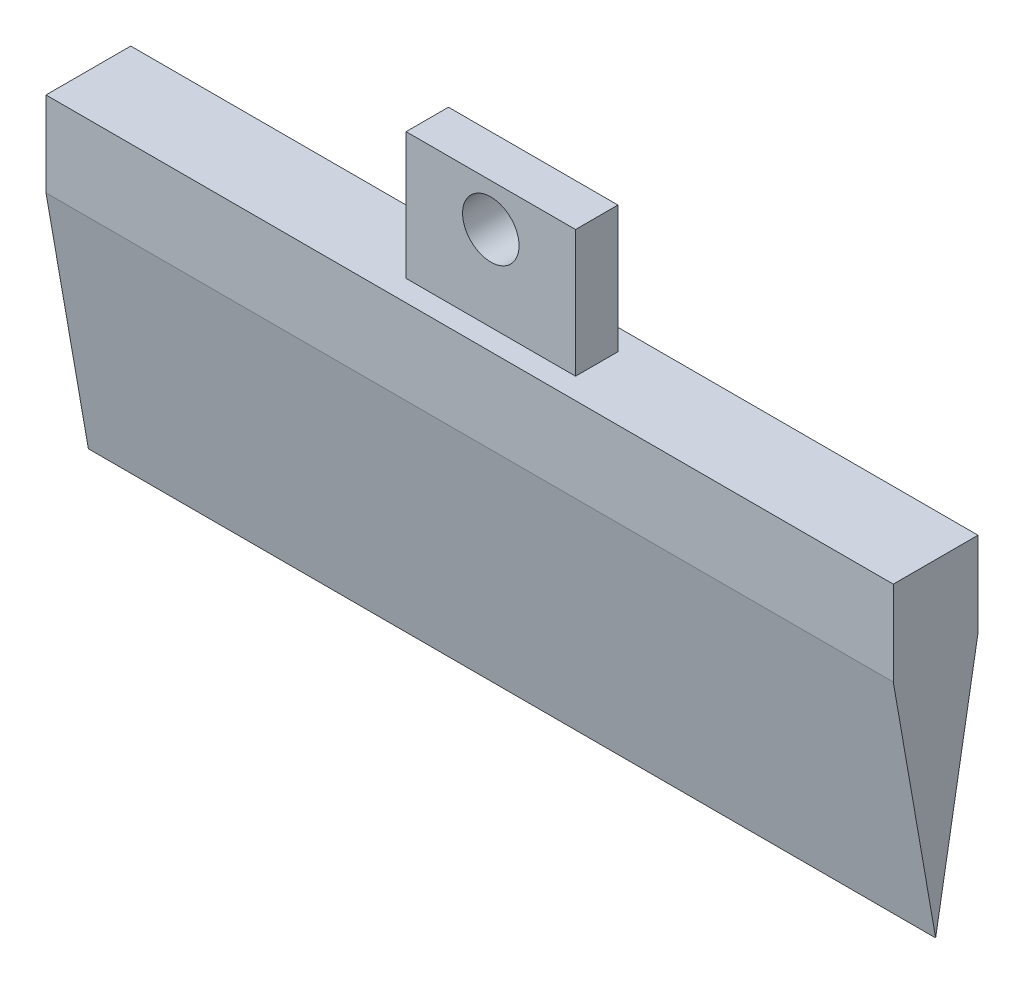
ISO-10303-21;
HEADER;
FILE_DESCRIPTION(('STEP AP214'),'2;1');
FILE_NAME('part.step','',(''),(''),'','','');
FILE_SCHEMA(('AUTOMOTIVE_DESIGN { 1 0 10303 214 1 1 1 1 }'));
ENDSEC;
DATA;
#1=APPLICATION_CONTEXT('core data for automotive mechanical design processes');
#2=APPLICATION_PROTOCOL_DEFINITION('international standard','automotive_design',2000,#1);
#3=PRODUCT_CONTEXT('',#1,'mechanical');
#4=PRODUCT('Part','Part','',(#3));
#5=PRODUCT_RELATED_PRODUCT_CATEGORY('part','',(#4));
#6=PRODUCT_DEFINITION_FORMATION('','',#4);
#7=PRODUCT_DEFINITION_CONTEXT('part definition',#1,'design');
#8=PRODUCT_DEFINITION('design','',#6,#7);
#9=PRODUCT_DEFINITION_SHAPE('','',#8);
#10=(LENGTH_UNIT() NAMED_UNIT(*) SI_UNIT(.MILLI.,.METRE.));
#11=(NAMED_UNIT(*) PLANE_ANGLE_UNIT() SI_UNIT($,.RADIAN.));
#12=(NAMED_UNIT(*) SI_UNIT($,.STERADIAN.) SOLID_ANGLE_UNIT());
#13=UNCERTAINTY_MEASURE_WITH_UNIT(LENGTH_MEASURE(1.E-05),#10,'distance_accuracy_value','');
#14=(GEOMETRIC_REPRESENTATION_CONTEXT(3) GLOBAL_UNCERTAINTY_ASSIGNED_CONTEXT((#13)) GLOBAL_UNIT_ASSIGNED_CONTEXT((#10,
#11,#12)) REPRESENTATION_CONTEXT('',''));
#15=CARTESIAN_POINT('',(0.,0.,0.));
#16=DIRECTION('',(0.,0.,1.));
#17=DIRECTION('',(1.,0.,0.));
#18=AXIS2_PLACEMENT_3D('',#15,#16,#17);
#19=CARTESIAN_POINT('',(-300.,0.,15.));
#20=DIRECTION('',(0.,1.,0.));
#21=DIRECTION('',(0.,0.,1.));
#22=AXIS2_PLACEMENT_3D('',#19,#20,#21);
#23=PLANE('',#22);
#24=DIRECTION('',(0.,0.,1.));
#25=VECTOR('',#24,1.);
#26=CARTESIAN_POINT('',(0.,0.,15.));
#27=LINE('',#26,#25);
#28=CARTESIAN_POINT('',(0.,0.,-15.));
#29=VERTEX_POINT('',#28);
#30=CARTESIAN_POINT('',(0.,0.,15.));
#31=VERTEX_POINT('',#30);
#32=EDGE_CURVE('E137',#29,#31,#27,.T.);
#33=ORIENTED_EDGE('',*,*,#32,.F.);
#34=DIRECTION('',(1.,0.,0.));
#35=VECTOR('',#34,1.);
#36=CARTESIAN_POINT('',(-300.,0.,-15.));
#37=LINE('',#36,#35);
#38=CARTESIAN_POINT('',(-300.,0.,-15.));
#39=VERTEX_POINT('',#38);
#40=EDGE_CURVE('E45',#39,#29,#37,.T.);
#41=ORIENTED_EDGE('',*,*,#40,.F.);
#42=DIRECTION('',(0.,0.,1.));
#43=VECTOR('',#42,1.);
#44=CARTESIAN_POINT('',(-300.,0.,15.));
#45=LINE('',#44,#43);
#46=CARTESIAN_POINT('',(-300.,0.,15.));
#47=VERTEX_POINT('',#46);
#48=EDGE_CURVE('E117',#39,#47,#45,.T.);
#49=ORIENTED_EDGE('',*,*,#48,.T.);
#50=DIRECTION('',(1.,0.,0.));
#51=VECTOR('',#50,1.);
#52=CARTESIAN_POINT('',(-300.,0.,15.));
#53=LINE('',#52,#51);
#54=EDGE_CURVE('E11',#47,#31,#53,.T.);
#55=ORIENTED_EDGE('',*,*,#54,.T.);
#56=EDGE_LOOP('',(#33,#41,#49,#55));
#57=FACE_BOUND('',#56,.T.);
#58=DIRECTION('',(0.,0.,-1.));
#59=VECTOR('',#58,1.);
#60=CARTESIAN_POINT('',(-180.,0.,7.5));
#61=LINE('',#60,#59);
#62=CARTESIAN_POINT('',(-180.,0.,7.5));
#63=VERTEX_POINT('',#62);
#64=CARTESIAN_POINT('',(-180.,0.,-7.5));
#65=VERTEX_POINT('',#64);
#66=EDGE_CURVE('E149',#63,#65,#61,.T.);
#67=ORIENTED_EDGE('',*,*,#66,.T.);
#68=DIRECTION('',(1.,0.,0.));
#69=VECTOR('',#68,1.);
#70=CARTESIAN_POINT('',(-120.,0.,-7.5));
#71=LINE('',#70,#69);
#72=CARTESIAN_POINT('',(-120.,0.,-7.5));
#73=VERTEX_POINT('',#72);
#74=EDGE_CURVE('E53',#65,#73,#71,.T.);
#75=ORIENTED_EDGE('',*,*,#74,.T.);
#76=DIRECTION('',(0.,0.,-1.));
#77=VECTOR('',#76,1.);
#78=CARTESIAN_POINT('',(-120.,0.,7.5));
#79=LINE('',#78,#77);
#80=CARTESIAN_POINT('',(-120.,0.,7.5));
#81=VERTEX_POINT('',#80);
#82=EDGE_CURVE('E157',#81,#73,#79,.T.);
#83=ORIENTED_EDGE('',*,*,#82,.F.);
#84=DIRECTION('',(1.,0.,0.));
#85=VECTOR('',#84,1.);
#86=CARTESIAN_POINT('',(-120.,0.,7.5));
#87=LINE('',#86,#85);
#88=EDGE_CURVE('E153',#63,#81,#87,.T.);
#89=ORIENTED_EDGE('',*,*,#88,.F.);
#90=EDGE_LOOP('',(#67,#75,#83,#89));
#91=FACE_BOUND('',#90,.T.);
#92=ADVANCED_FACE('F36',(#57,#91),#23,.T.);
#93=CARTESIAN_POINT('',(-300.,-30.,15.));
#94=DIRECTION('',(0.,0.,1.));
#95=DIRECTION('',(1.,0.,0.));
#96=AXIS2_PLACEMENT_3D('',#93,#94,#95);
#97=PLANE('',#96);
#98=DIRECTION('',(0.,-1.,0.));
#99=VECTOR('',#98,1.);
#100=CARTESIAN_POINT('',(0.,-30.,15.));
#101=LINE('',#100,#99);
#102=CARTESIAN_POINT('',(0.,-30.,15.));
#103=VERTEX_POINT('',#102);
#104=EDGE_CURVE('E127',#31,#103,#101,.T.);
#105=ORIENTED_EDGE('',*,*,#104,.F.);
#106=ORIENTED_EDGE('',*,*,#54,.F.);
#107=DIRECTION('',(0.,-1.,0.));
#108=VECTOR('',#107,1.);
#109=CARTESIAN_POINT('',(-300.,-30.,15.));
#110=LINE('',#109,#108);
#111=CARTESIAN_POINT('',(-300.,-30.,15.));
#112=VERTEX_POINT('',#111);
#113=EDGE_CURVE('E122',#47,#112,#110,.T.);
#114=ORIENTED_EDGE('',*,*,#113,.T.);
#115=DIRECTION('',(1.,0.,0.));
#116=VECTOR('',#115,1.);
#117=CARTESIAN_POINT('',(-300.,-30.,15.));
#118=LINE('',#117,#116);
#119=EDGE_CURVE('E40',#112,#103,#118,.T.);
#120=ORIENTED_EDGE('',*,*,#119,.T.);
#121=EDGE_LOOP('',(#105,#106,#114,#120));
#122=FACE_BOUND('',#121,.T.);
#123=ADVANCED_FACE('F38',(#122),#97,.T.);
#124=CARTESIAN_POINT('',(-300.,0.,-15.));
#125=DIRECTION('',(0.,0.,-1.));
#126=DIRECTION('',(-1.,0.,0.));
#127=AXIS2_PLACEMENT_3D('',#124,#125,#126);
#128=PLANE('',#127);
#129=DIRECTION('',(0.,1.,0.));
#130=VECTOR('',#129,1.);
#131=CARTESIAN_POINT('',(0.,0.,-15.));
#132=LINE('',#131,#130);
#133=CARTESIAN_POINT('',(0.,-30.,-15.));
#134=VERTEX_POINT('',#133);
#135=EDGE_CURVE('E106',#134,#29,#132,.T.);
#136=ORIENTED_EDGE('',*,*,#135,.F.);
#137=DIRECTION('',(1.,0.,0.));
#138=VECTOR('',#137,1.);
#139=CARTESIAN_POINT('',(-300.,-30.,-15.));
#140=LINE('',#139,#138);
#141=CARTESIAN_POINT('',(-300.,-30.,-15.));
#142=VERTEX_POINT('',#141);
#143=EDGE_CURVE('E100',#142,#134,#140,.T.);
#144=ORIENTED_EDGE('',*,*,#143,.F.);
#145=DIRECTION('',(0.,1.,0.));
#146=VECTOR('',#145,1.);
#147=CARTESIAN_POINT('',(-300.,0.,-15.));
#148=LINE('',#147,#146);
#149=EDGE_CURVE('E103',#142,#39,#148,.T.);
#150=ORIENTED_EDGE('',*,*,#149,.T.);
#151=ORIENTED_EDGE('',*,*,#40,.T.);
#152=EDGE_LOOP('',(#136,#144,#150,#151));
#153=FACE_BOUND('',#152,.T.);
#154=ADVANCED_FACE('F102',(#153),#128,.T.);
#155=CARTESIAN_POINT('',(-300.,-30.,-15.));
#156=DIRECTION('',(0.,-0.171824574947336,-0.985127563031391));
#157=DIRECTION('',(0.,0.985127563031391,-0.171824574947336));
#158=AXIS2_PLACEMENT_3D('',#155,#156,#157);
#159=PLANE('',#158);
#160=DIRECTION('',(0.,0.985127563031391,-0.171824574947336));
#161=VECTOR('',#160,1.);
#162=CARTESIAN_POINT('',(0.,-30.,-15.));
#163=LINE('',#162,#161);
#164=CARTESIAN_POINT('',(0.,-116.,0.));
#165=VERTEX_POINT('',#164);
#166=EDGE_CURVE('E134',#165,#134,#163,.T.);
#167=ORIENTED_EDGE('',*,*,#166,.F.);
#168=DIRECTION('',(1.,0.,0.));
#169=VECTOR('',#168,1.);
#170=CARTESIAN_POINT('',(-300.,-116.,0.));
#171=LINE('',#170,#169);
#172=CARTESIAN_POINT('',(-300.,-116.,0.));
#173=VERTEX_POINT('',#172);
#174=EDGE_CURVE('E111',#173,#165,#171,.T.);
#175=ORIENTED_EDGE('',*,*,#174,.F.);
#176=DIRECTION('',(0.,0.985127563031391,-0.171824574947336));
#177=VECTOR('',#176,1.);
#178=CARTESIAN_POINT('',(-300.,-30.,-15.));
#179=LINE('',#178,#177);
#180=EDGE_CURVE('E116',#173,#142,#179,.T.);
#181=ORIENTED_EDGE('',*,*,#180,.T.);
#182=ORIENTED_EDGE('',*,*,#143,.T.);
#183=EDGE_LOOP('',(#167,#175,#181,#182));
#184=FACE_BOUND('',#183,.T.);
#185=ADVANCED_FACE('F119',(#184),#159,.T.);
#186=CARTESIAN_POINT('',(-300.,-116.,0.));
#187=DIRECTION('',(0.,-0.171824574947336,0.985127563031391));
#188=DIRECTION('',(0.,-0.985127563031391,-0.171824574947336));
#189=AXIS2_PLACEMENT_3D('',#186,#187,#188);
#190=PLANE('',#189);
#191=DIRECTION('',(0.,-0.985127563031391,-0.171824574947336));
#192=VECTOR('',#191,1.);
#193=CARTESIAN_POINT('',(0.,-116.,0.));
#194=LINE('',#193,#192);
#195=EDGE_CURVE('E130',#103,#165,#194,.T.);
#196=ORIENTED_EDGE('',*,*,#195,.F.);
#197=ORIENTED_EDGE('',*,*,#119,.F.);
#198=DIRECTION('',(0.,-0.985127563031391,-0.171824574947336));
#199=VECTOR('',#198,1.);
#200=CARTESIAN_POINT('',(-300.,-116.,0.));
#201=LINE('',#200,#199);
#202=EDGE_CURVE('E120',#112,#173,#201,.T.);
#203=ORIENTED_EDGE('',*,*,#202,.T.);
#204=ORIENTED_EDGE('',*,*,#174,.T.);
#205=EDGE_LOOP('',(#196,#197,#203,#204));
#206=FACE_BOUND('',#205,.T.);
#207=ADVANCED_FACE('F140',(#206),#190,.T.);
#208=CARTESIAN_POINT('',(-300.,0.,0.));
#209=DIRECTION('',(-1.,0.,0.));
#210=DIRECTION('',(0.,0.,1.));
#211=AXIS2_PLACEMENT_3D('',#208,#209,#210);
#212=PLANE('',#211);
#213=ORIENTED_EDGE('',*,*,#113,.F.);
#214=ORIENTED_EDGE('',*,*,#48,.F.);
#215=ORIENTED_EDGE('',*,*,#149,.F.);
#216=ORIENTED_EDGE('',*,*,#180,.F.);
#217=ORIENTED_EDGE('',*,*,#202,.F.);
#218=EDGE_LOOP('',(#213,#214,#215,#216,#217));
#219=FACE_BOUND('',#218,.T.);
#220=ADVANCED_FACE('F115',(#219),#212,.T.);
#221=CARTESIAN_POINT('',(0.,0.,0.));
#222=DIRECTION('',(-1.,0.,0.));
#223=DIRECTION('',(0.,0.,1.));
#224=AXIS2_PLACEMENT_3D('',#221,#222,#223);
#225=PLANE('',#224);
#226=ORIENTED_EDGE('',*,*,#104,.T.);
#227=ORIENTED_EDGE('',*,*,#195,.T.);
#228=ORIENTED_EDGE('',*,*,#166,.T.);
#229=ORIENTED_EDGE('',*,*,#135,.T.);
#230=ORIENTED_EDGE('',*,*,#32,.T.);
#231=EDGE_LOOP('',(#226,#227,#228,#229,#230));
#232=FACE_BOUND('',#231,.T.);
#233=ADVANCED_FACE('F142',(#232),#225,.F.);
#234=CARTESIAN_POINT('',(0.,0.,7.5));
#235=DIRECTION('',(0.,0.,-1.));
#236=DIRECTION('',(-1.,0.,0.));
#237=AXIS2_PLACEMENT_3D('',#234,#235,#236);
#238=PLANE('',#237);
#239=DIRECTION('',(0.,1.,0.));
#240=VECTOR('',#239,1.);
#241=CARTESIAN_POINT('',(-120.,45.,7.5));
#242=LINE('',#241,#240);
#243=CARTESIAN_POINT('',(-120.,45.,7.5));
#244=VERTEX_POINT('',#243);
#245=EDGE_CURVE('E196',#81,#244,#242,.T.);
#246=ORIENTED_EDGE('',*,*,#245,.T.);
#247=DIRECTION('',(-1.,0.,0.));
#248=VECTOR('',#247,1.);
#249=CARTESIAN_POINT('',(-120.,45.,7.5));
#250=LINE('',#249,#248);
#251=CARTESIAN_POINT('',(-180.,45.,7.5));
#252=VERTEX_POINT('',#251);
#253=EDGE_CURVE('E179',#244,#252,#250,.T.);
#254=ORIENTED_EDGE('',*,*,#253,.T.);
#255=DIRECTION('',(0.,-1.,0.));
#256=VECTOR('',#255,1.);
#257=CARTESIAN_POINT('',(-180.,45.,7.5));
#258=LINE('',#257,#256);
#259=EDGE_CURVE('E199',#252,#63,#258,.T.);
#260=ORIENTED_EDGE('',*,*,#259,.T.);
#261=ORIENTED_EDGE('',*,*,#88,.T.);
#262=EDGE_LOOP('',(#246,#254,#260,#261));
#263=FACE_BOUND('',#262,.T.);
#264=CARTESIAN_POINT('',(-150.,30.,7.5));
#265=DIRECTION('',(0.,0.,1.));
#266=DIRECTION('',(1.,0.,0.));
#267=AXIS2_PLACEMENT_3D('',#264,#265,#266);
#268=CIRCLE('',#267,10.);
#269=CARTESIAN_POINT('',(-140.,30.,7.5));
#270=VERTEX_POINT('',#269);
#271=EDGE_CURVE('E186',#270,#270,#268,.T.);
#272=ORIENTED_EDGE('',*,*,#271,.F.);
#273=EDGE_LOOP('',(#272));
#274=FACE_BOUND('',#273,.T.);
#275=ADVANCED_FACE('F203',(#263,#274),#238,.F.);
#276=CARTESIAN_POINT('',(0.,0.,-7.5));
#277=DIRECTION('',(0.,0.,-1.));
#278=DIRECTION('',(-1.,0.,0.));
#279=AXIS2_PLACEMENT_3D('',#276,#277,#278);
#280=PLANE('',#279);
#281=DIRECTION('',(0.,1.,0.));
#282=VECTOR('',#281,1.);
#283=CARTESIAN_POINT('',(-120.,45.,-7.5));
#284=LINE('',#283,#282);
#285=CARTESIAN_POINT('',(-120.,45.,-7.5));
#286=VERTEX_POINT('',#285);
#287=EDGE_CURVE('E184',#73,#286,#284,.T.);
#288=ORIENTED_EDGE('',*,*,#287,.F.);
#289=ORIENTED_EDGE('',*,*,#74,.F.);
#290=DIRECTION('',(0.,-1.,0.));
#291=VECTOR('',#290,1.);
#292=CARTESIAN_POINT('',(-180.,45.,-7.5));
#293=LINE('',#292,#291);
#294=CARTESIAN_POINT('',(-180.,45.,-7.5));
#295=VERTEX_POINT('',#294);
#296=EDGE_CURVE('E188',#295,#65,#293,.T.);
#297=ORIENTED_EDGE('',*,*,#296,.F.);
#298=DIRECTION('',(-1.,0.,0.));
#299=VECTOR('',#298,1.);
#300=CARTESIAN_POINT('',(-120.,45.,-7.5));
#301=LINE('',#300,#299);
#302=EDGE_CURVE('E176',#286,#295,#301,.T.);
#303=ORIENTED_EDGE('',*,*,#302,.F.);
#304=EDGE_LOOP('',(#288,#289,#297,#303));
#305=FACE_BOUND('',#304,.T.);
#306=CARTESIAN_POINT('',(-150.,30.,-7.5));
#307=DIRECTION('',(0.,0.,1.));
#308=DIRECTION('',(1.,0.,0.));
#309=AXIS2_PLACEMENT_3D('',#306,#307,#308);
#310=CIRCLE('',#309,10.);
#311=CARTESIAN_POINT('',(-140.,30.,-7.5));
#312=VERTEX_POINT('',#311);
#313=EDGE_CURVE('E191',#312,#312,#310,.T.);
#314=ORIENTED_EDGE('',*,*,#313,.T.);
#315=EDGE_LOOP('',(#314));
#316=FACE_BOUND('',#315,.T.);
#317=ADVANCED_FACE('F222',(#305,#316),#280,.T.);
#318=CARTESIAN_POINT('',(-120.,45.,7.5));
#319=DIRECTION('',(-1.,0.,0.));
#320=DIRECTION('',(0.,0.,1.));
#321=AXIS2_PLACEMENT_3D('',#318,#319,#320);
#322=PLANE('',#321);
#323=ORIENTED_EDGE('',*,*,#287,.T.);
#324=DIRECTION('',(0.,0.,-1.));
#325=VECTOR('',#324,1.);
#326=CARTESIAN_POINT('',(-120.,45.,7.5));
#327=LINE('',#326,#325);
#328=EDGE_CURVE('E131',#244,#286,#327,.T.);
#329=ORIENTED_EDGE('',*,*,#328,.F.);
#330=ORIENTED_EDGE('',*,*,#245,.F.);
#331=ORIENTED_EDGE('',*,*,#82,.T.);
#332=EDGE_LOOP('',(#323,#329,#330,#331));
#333=FACE_BOUND('',#332,.T.);
#334=ADVANCED_FACE('F185',(#333),#322,.F.);
#335=CARTESIAN_POINT('',(-120.,45.,7.5));
#336=DIRECTION('',(0.,-1.,0.));
#337=DIRECTION('',(0.,0.,-1.));
#338=AXIS2_PLACEMENT_3D('',#335,#336,#337);
#339=PLANE('',#338);
#340=ORIENTED_EDGE('',*,*,#302,.T.);
#341=DIRECTION('',(0.,0.,-1.));
#342=VECTOR('',#341,1.);
#343=CARTESIAN_POINT('',(-180.,45.,7.5));
#344=LINE('',#343,#342);
#345=EDGE_CURVE('E156',#252,#295,#344,.T.);
#346=ORIENTED_EDGE('',*,*,#345,.F.);
#347=ORIENTED_EDGE('',*,*,#253,.F.);
#348=ORIENTED_EDGE('',*,*,#328,.T.);
#349=EDGE_LOOP('',(#340,#346,#347,#348));
#350=FACE_BOUND('',#349,.T.);
#351=ADVANCED_FACE('F172',(#350),#339,.F.);
#352=CARTESIAN_POINT('',(-180.,45.,7.5));
#353=DIRECTION('',(1.,0.,0.));
#354=DIRECTION('',(0.,0.,-1.));
#355=AXIS2_PLACEMENT_3D('',#352,#353,#354);
#356=PLANE('',#355);
#357=ORIENTED_EDGE('',*,*,#296,.T.);
#358=ORIENTED_EDGE('',*,*,#66,.F.);
#359=ORIENTED_EDGE('',*,*,#259,.F.);
#360=ORIENTED_EDGE('',*,*,#345,.T.);
#361=EDGE_LOOP('',(#357,#358,#359,#360));
#362=FACE_BOUND('',#361,.T.);
#363=ADVANCED_FACE('F210',(#362),#356,.F.);
#364=CARTESIAN_POINT('',(-150.,30.,7.5));
#365=DIRECTION('',(0.,0.,-1.));
#366=DIRECTION('',(-1.,0.,0.));
#367=AXIS2_PLACEMENT_3D('',#364,#365,#366);
#368=CYLINDRICAL_SURFACE('',#367,10.);
#369=ORIENTED_EDGE('',*,*,#271,.T.);
#370=EDGE_LOOP('',(#369));
#371=FACE_BOUND('',#370,.T.);
#372=ORIENTED_EDGE('',*,*,#313,.F.);
#373=EDGE_LOOP('',(#372));
#374=FACE_BOUND('',#373,.T.);
#375=ADVANCED_FACE('F212',(#371,#374),#368,.F.);
#376=CLOSED_SHELL('',(#92,#123,#154,#185,#207,#220,#233,#275,#317,#334,#351,#363,#375));
#377=MANIFOLD_SOLID_BREP('B2',#376);
#378=ADVANCED_BREP_SHAPE_REPRESENTATION('',(#18,#377),#14);
#379=SHAPE_DEFINITION_REPRESENTATION(#9,#378);
ENDSEC;
END-ISO-10303-21;
